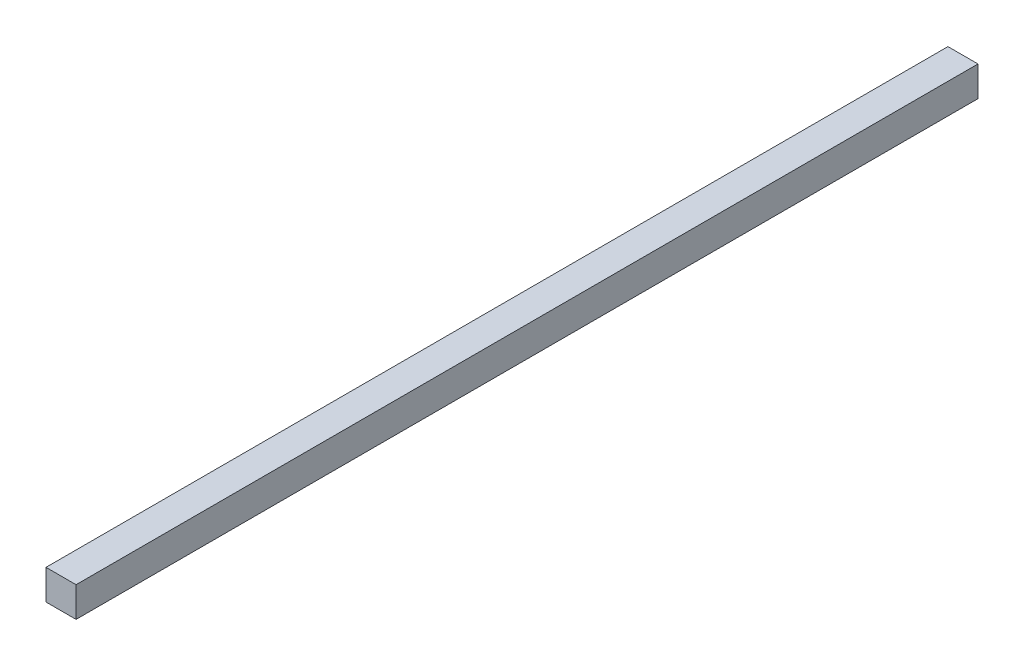
ISO-10303-21;
HEADER;
FILE_DESCRIPTION(('STEP AP214'),'2;1');
FILE_NAME('part.step','',(''),(''),'','','');
FILE_SCHEMA(('AUTOMOTIVE_DESIGN { 1 0 10303 214 1 1 1 1 }'));
ENDSEC;
DATA;
#1=APPLICATION_CONTEXT('core data for automotive mechanical design processes');
#2=APPLICATION_PROTOCOL_DEFINITION('international standard','automotive_design',2000,#1);
#3=PRODUCT_CONTEXT('',#1,'mechanical');
#4=PRODUCT('Part','Part','',(#3));
#5=PRODUCT_RELATED_PRODUCT_CATEGORY('part','',(#4));
#6=PRODUCT_DEFINITION_FORMATION('','',#4);
#7=PRODUCT_DEFINITION_CONTEXT('part definition',#1,'design');
#8=PRODUCT_DEFINITION('design','',#6,#7);
#9=PRODUCT_DEFINITION_SHAPE('','',#8);
#10=(LENGTH_UNIT() NAMED_UNIT(*) SI_UNIT(.MILLI.,.METRE.));
#11=(NAMED_UNIT(*) PLANE_ANGLE_UNIT() SI_UNIT($,.RADIAN.));
#12=(NAMED_UNIT(*) SI_UNIT($,.STERADIAN.) SOLID_ANGLE_UNIT());
#13=UNCERTAINTY_MEASURE_WITH_UNIT(LENGTH_MEASURE(1.E-05),#10,'distance_accuracy_value','');
#14=(GEOMETRIC_REPRESENTATION_CONTEXT(3) GLOBAL_UNCERTAINTY_ASSIGNED_CONTEXT((#13)) GLOBAL_UNIT_ASSIGNED_CONTEXT((#10,
#11,#12)) REPRESENTATION_CONTEXT('',''));
#15=CARTESIAN_POINT('',(0.,0.,0.));
#16=DIRECTION('',(0.,0.,1.));
#17=DIRECTION('',(1.,0.,0.));
#18=AXIS2_PLACEMENT_3D('',#15,#16,#17);
#19=CARTESIAN_POINT('',(11.6609090909092,22.8600000000001,762.));
#20=DIRECTION('',(1.,0.,0.));
#21=DIRECTION('',(0.,1.,0.));
#22=AXIS2_PLACEMENT_3D('',#19,#20,#21);
#23=PLANE('',#22);
#24=DIRECTION('',(0.,-1.,0.));
#25=VECTOR('',#24,1.);
#26=CARTESIAN_POINT('',(11.6609090909092,22.8600000000001,0.));
#27=LINE('',#26,#25);
#28=CARTESIAN_POINT('',(11.6609090909092,22.8600000000001,0.));
#29=VERTEX_POINT('',#28);
#30=CARTESIAN_POINT('',(11.6609090909092,-2.53999999999994,0.));
#31=VERTEX_POINT('',#30);
#32=EDGE_CURVE('E96',#29,#31,#27,.T.);
#33=ORIENTED_EDGE('',*,*,#32,.T.);
#34=DIRECTION('',(0.,0.,-1.));
#35=VECTOR('',#34,1.);
#36=CARTESIAN_POINT('',(11.6609090909092,-2.53999999999994,762.));
#37=LINE('',#36,#35);
#38=CARTESIAN_POINT('',(11.6609090909092,-2.53999999999994,762.));
#39=VERTEX_POINT('',#38);
#40=EDGE_CURVE('E11',#39,#31,#37,.T.);
#41=ORIENTED_EDGE('',*,*,#40,.F.);
#42=DIRECTION('',(0.,-1.,0.));
#43=VECTOR('',#42,1.);
#44=CARTESIAN_POINT('',(11.6609090909092,22.8600000000001,762.));
#45=LINE('',#44,#43);
#46=CARTESIAN_POINT('',(11.6609090909092,22.8600000000001,762.));
#47=VERTEX_POINT('',#46);
#48=EDGE_CURVE('E84',#47,#39,#45,.T.);
#49=ORIENTED_EDGE('',*,*,#48,.F.);
#50=DIRECTION('',(0.,0.,-1.));
#51=VECTOR('',#50,1.);
#52=CARTESIAN_POINT('',(11.6609090909092,22.8600000000001,762.));
#53=LINE('',#52,#51);
#54=EDGE_CURVE('E92',#47,#29,#53,.T.);
#55=ORIENTED_EDGE('',*,*,#54,.T.);
#56=EDGE_LOOP('',(#33,#41,#49,#55));
#57=FACE_BOUND('',#56,.T.);
#58=ADVANCED_FACE('F33',(#57),#23,.F.);
#59=CARTESIAN_POINT('',(37.0609090909092,-2.53999999999994,762.));
#60=DIRECTION('',(0.,1.,0.));
#61=DIRECTION('',(-1.,0.,0.));
#62=AXIS2_PLACEMENT_3D('',#59,#60,#61);
#63=PLANE('',#62);
#64=DIRECTION('',(1.,0.,0.));
#65=VECTOR('',#64,1.);
#66=CARTESIAN_POINT('',(37.0609090909092,-2.53999999999994,0.));
#67=LINE('',#66,#65);
#68=CARTESIAN_POINT('',(37.0609090909092,-2.53999999999994,0.));
#69=VERTEX_POINT('',#68);
#70=EDGE_CURVE('E88',#31,#69,#67,.T.);
#71=ORIENTED_EDGE('',*,*,#70,.T.);
#72=DIRECTION('',(0.,0.,-1.));
#73=VECTOR('',#72,1.);
#74=CARTESIAN_POINT('',(37.0609090909092,-2.53999999999994,762.));
#75=LINE('',#74,#73);
#76=CARTESIAN_POINT('',(37.0609090909092,-2.53999999999994,762.));
#77=VERTEX_POINT('',#76);
#78=EDGE_CURVE('E41',#77,#69,#75,.T.);
#79=ORIENTED_EDGE('',*,*,#78,.F.);
#80=DIRECTION('',(1.,0.,0.));
#81=VECTOR('',#80,1.);
#82=CARTESIAN_POINT('',(37.0609090909092,-2.53999999999994,762.));
#83=LINE('',#82,#81);
#84=EDGE_CURVE('E79',#39,#77,#83,.T.);
#85=ORIENTED_EDGE('',*,*,#84,.F.);
#86=ORIENTED_EDGE('',*,*,#40,.T.);
#87=EDGE_LOOP('',(#71,#79,#85,#86));
#88=FACE_BOUND('',#87,.T.);
#89=ADVANCED_FACE('F87',(#88),#63,.F.);
#90=CARTESIAN_POINT('',(37.0609090909092,22.8600000000001,762.));
#91=DIRECTION('',(-1.,0.,0.));
#92=DIRECTION('',(0.,-1.,0.));
#93=AXIS2_PLACEMENT_3D('',#90,#91,#92);
#94=PLANE('',#93);
#95=DIRECTION('',(0.,1.,0.));
#96=VECTOR('',#95,1.);
#97=CARTESIAN_POINT('',(37.0609090909092,22.8600000000001,0.));
#98=LINE('',#97,#96);
#99=CARTESIAN_POINT('',(37.0609090909092,22.8600000000001,0.));
#100=VERTEX_POINT('',#99);
#101=EDGE_CURVE('E66',#69,#100,#98,.T.);
#102=ORIENTED_EDGE('',*,*,#101,.T.);
#103=DIRECTION('',(0.,0.,-1.));
#104=VECTOR('',#103,1.);
#105=CARTESIAN_POINT('',(37.0609090909092,22.8600000000001,762.));
#106=LINE('',#105,#104);
#107=CARTESIAN_POINT('',(37.0609090909092,22.8600000000001,762.));
#108=VERTEX_POINT('',#107);
#109=EDGE_CURVE('E89',#108,#100,#106,.T.);
#110=ORIENTED_EDGE('',*,*,#109,.F.);
#111=DIRECTION('',(0.,1.,0.));
#112=VECTOR('',#111,1.);
#113=CARTESIAN_POINT('',(37.0609090909092,22.8600000000001,762.));
#114=LINE('',#113,#112);
#115=EDGE_CURVE('E82',#77,#108,#114,.T.);
#116=ORIENTED_EDGE('',*,*,#115,.F.);
#117=ORIENTED_EDGE('',*,*,#78,.T.);
#118=EDGE_LOOP('',(#102,#110,#116,#117));
#119=FACE_BOUND('',#118,.T.);
#120=ADVANCED_FACE('F90',(#119),#94,.F.);
#121=CARTESIAN_POINT('',(37.0609090909092,22.8600000000001,762.));
#122=DIRECTION('',(0.,-1.,0.));
#123=DIRECTION('',(0.,0.,-1.));
#124=AXIS2_PLACEMENT_3D('',#121,#122,#123);
#125=PLANE('',#124);
#126=DIRECTION('',(-1.,0.,0.));
#127=VECTOR('',#126,1.);
#128=CARTESIAN_POINT('',(37.0609090909092,22.8600000000001,0.));
#129=LINE('',#128,#127);
#130=EDGE_CURVE('E72',#100,#29,#129,.T.);
#131=ORIENTED_EDGE('',*,*,#130,.T.);
#132=ORIENTED_EDGE('',*,*,#54,.F.);
#133=DIRECTION('',(-1.,0.,0.));
#134=VECTOR('',#133,1.);
#135=CARTESIAN_POINT('',(37.0609090909092,22.8600000000001,762.));
#136=LINE('',#135,#134);
#137=EDGE_CURVE('E49',#108,#47,#136,.T.);
#138=ORIENTED_EDGE('',*,*,#137,.F.);
#139=ORIENTED_EDGE('',*,*,#109,.T.);
#140=EDGE_LOOP('',(#131,#132,#138,#139));
#141=FACE_BOUND('',#140,.T.);
#142=ADVANCED_FACE('F103',(#141),#125,.F.);
#143=CARTESIAN_POINT('',(0.,0.,762.));
#144=DIRECTION('',(0.,0.,-1.));
#145=DIRECTION('',(-1.,0.,0.));
#146=AXIS2_PLACEMENT_3D('',#143,#144,#145);
#147=PLANE('',#146);
#148=ORIENTED_EDGE('',*,*,#48,.T.);
#149=ORIENTED_EDGE('',*,*,#84,.T.);
#150=ORIENTED_EDGE('',*,*,#115,.T.);
#151=ORIENTED_EDGE('',*,*,#137,.T.);
#152=EDGE_LOOP('',(#148,#149,#150,#151));
#153=FACE_BOUND('',#152,.T.);
#154=ADVANCED_FACE('F80',(#153),#147,.F.);
#155=CARTESIAN_POINT('',(0.,0.,0.));
#156=DIRECTION('',(0.,0.,-1.));
#157=DIRECTION('',(-1.,0.,0.));
#158=AXIS2_PLACEMENT_3D('',#155,#156,#157);
#159=PLANE('',#158);
#160=ORIENTED_EDGE('',*,*,#32,.F.);
#161=ORIENTED_EDGE('',*,*,#130,.F.);
#162=ORIENTED_EDGE('',*,*,#101,.F.);
#163=ORIENTED_EDGE('',*,*,#70,.F.);
#164=EDGE_LOOP('',(#160,#161,#162,#163));
#165=FACE_BOUND('',#164,.T.);
#166=ADVANCED_FACE('F106',(#165),#159,.T.);
#167=CLOSED_SHELL('',(#58,#89,#120,#142,#154,#166));
#168=MANIFOLD_SOLID_BREP('B2',#167);
#169=ADVANCED_BREP_SHAPE_REPRESENTATION('',(#18,#168),#14);
#170=SHAPE_DEFINITION_REPRESENTATION(#9,#169);
ENDSEC;
END-ISO-10303-21;
